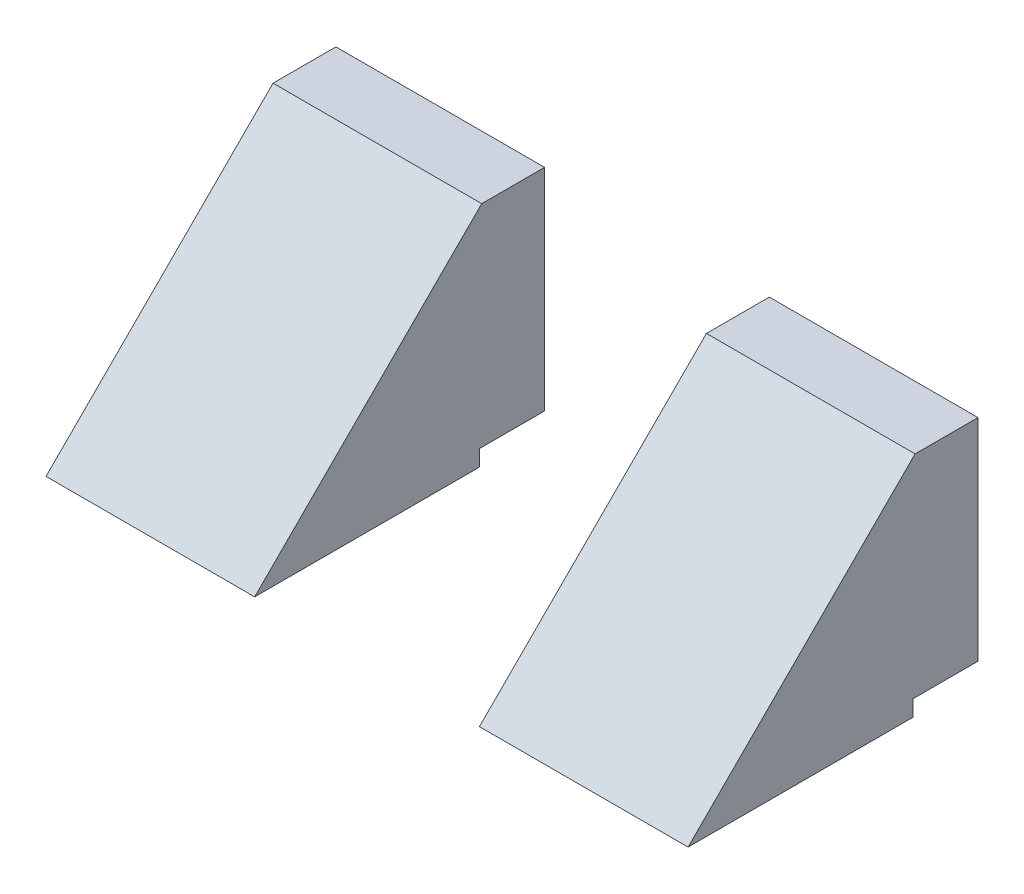
ISO-10303-21;
HEADER;
FILE_DESCRIPTION(('STEP AP214'),'2;1');
FILE_NAME('part.step','',(''),(''),'','','');
FILE_SCHEMA(('AUTOMOTIVE_DESIGN { 1 0 10303 214 1 1 1 1 }'));
ENDSEC;
DATA;
#1=APPLICATION_CONTEXT('core data for automotive mechanical design processes');
#2=APPLICATION_PROTOCOL_DEFINITION('international standard','automotive_design',2000,#1);
#3=PRODUCT_CONTEXT('',#1,'mechanical');
#4=PRODUCT('Part','Part','',(#3));
#5=PRODUCT_RELATED_PRODUCT_CATEGORY('part','',(#4));
#6=PRODUCT_DEFINITION_FORMATION('','',#4);
#7=PRODUCT_DEFINITION_CONTEXT('part definition',#1,'design');
#8=PRODUCT_DEFINITION('design','',#6,#7);
#9=PRODUCT_DEFINITION_SHAPE('','',#8);
#10=(LENGTH_UNIT() NAMED_UNIT(*) SI_UNIT(.MILLI.,.METRE.));
#11=(NAMED_UNIT(*) PLANE_ANGLE_UNIT() SI_UNIT($,.RADIAN.));
#12=(NAMED_UNIT(*) SI_UNIT($,.STERADIAN.) SOLID_ANGLE_UNIT());
#13=UNCERTAINTY_MEASURE_WITH_UNIT(LENGTH_MEASURE(1.E-05),#10,'distance_accuracy_value','');
#14=(GEOMETRIC_REPRESENTATION_CONTEXT(3) GLOBAL_UNCERTAINTY_ASSIGNED_CONTEXT((#13)) GLOBAL_UNIT_ASSIGNED_CONTEXT((#10,
#11,#12)) REPRESENTATION_CONTEXT('',''));
#15=CARTESIAN_POINT('',(0.,0.,0.));
#16=DIRECTION('',(0.,0.,1.));
#17=DIRECTION('',(1.,0.,0.));
#18=AXIS2_PLACEMENT_3D('',#15,#16,#17);
#19=CARTESIAN_POINT('',(200.,-25.754686226569,1.98850855745727));
#20=DIRECTION('',(0.,0.,1.));
#21=DIRECTION('',(0.,-1.,0.));
#22=AXIS2_PLACEMENT_3D('',#19,#20,#21);
#23=PLANE('',#22);
#24=DIRECTION('',(-1.,0.,0.));
#25=VECTOR('',#24,1.);
#26=CARTESIAN_POINT('',(200.,39.9594892936135,1.98850855745727));
#27=LINE('',#26,#25);
#28=CARTESIAN_POINT('',(65.,39.9594892936135,1.98850855745727));
#29=VERTEX_POINT('',#28);
#30=CARTESIAN_POINT('',(0.,39.9594892936135,1.98850855745727));
#31=VERTEX_POINT('',#30);
#32=EDGE_CURVE('E105',#29,#31,#27,.T.);
#33=ORIENTED_EDGE('',*,*,#32,.F.);
#34=DIRECTION('',(0.,1.,0.));
#35=VECTOR('',#34,1.);
#36=CARTESIAN_POINT('',(65.,-198.040510706386,1.98850855745735));
#37=LINE('',#36,#35);
#38=CARTESIAN_POINT('',(65.,-25.754686226569,1.98850855745729));
#39=VERTEX_POINT('',#38);
#40=EDGE_CURVE('E59',#39,#29,#37,.T.);
#41=ORIENTED_EDGE('',*,*,#40,.F.);
#42=DIRECTION('',(-1.,0.,0.));
#43=VECTOR('',#42,1.);
#44=CARTESIAN_POINT('',(200.,-25.754686226569,1.98850855745727));
#45=LINE('',#44,#43);
#46=CARTESIAN_POINT('',(0.,-25.754686226569,1.98850855745727));
#47=VERTEX_POINT('',#46);
#48=EDGE_CURVE('E52',#39,#47,#45,.T.);
#49=ORIENTED_EDGE('',*,*,#48,.T.);
#50=DIRECTION('',(0.,1.,0.));
#51=VECTOR('',#50,1.);
#52=CARTESIAN_POINT('',(0.,-25.754686226569,1.98850855745727));
#53=LINE('',#52,#51);
#54=EDGE_CURVE('E114',#47,#31,#53,.T.);
#55=ORIENTED_EDGE('',*,*,#54,.T.);
#56=EDGE_LOOP('',(#33,#41,#49,#55));
#57=FACE_BOUND('',#56,.T.);
#58=ADVANCED_FACE('F49',(#57),#23,.F.);
#59=CARTESIAN_POINT('',(200.,39.9594892936135,1.98850855745727));
#60=DIRECTION('',(0.,-1.,0.));
#61=DIRECTION('',(0.,0.,-1.));
#62=AXIS2_PLACEMENT_3D('',#59,#60,#61);
#63=PLANE('',#62);
#64=DIRECTION('',(-1.,0.,0.));
#65=VECTOR('',#64,1.);
#66=CARTESIAN_POINT('',(200.,39.9594892936135,21.574333037274));
#67=LINE('',#66,#65);
#68=CARTESIAN_POINT('',(65.,39.9594892936135,21.574333037274));
#69=VERTEX_POINT('',#68);
#70=CARTESIAN_POINT('',(0.,39.9594892936135,21.574333037274));
#71=VERTEX_POINT('',#70);
#72=EDGE_CURVE('E134',#69,#71,#67,.T.);
#73=ORIENTED_EDGE('',*,*,#72,.F.);
#74=DIRECTION('',(0.,0.,1.));
#75=VECTOR('',#74,1.);
#76=CARTESIAN_POINT('',(65.,39.9594892936135,1.98850855745727));
#77=LINE('',#76,#75);
#78=EDGE_CURVE('E12',#29,#69,#77,.T.);
#79=ORIENTED_EDGE('',*,*,#78,.F.);
#80=ORIENTED_EDGE('',*,*,#32,.T.);
#81=DIRECTION('',(0.,0.,1.));
#82=VECTOR('',#81,1.);
#83=CARTESIAN_POINT('',(0.,39.9594892936135,1.98850855745727));
#84=LINE('',#83,#82);
#85=EDGE_CURVE('E109',#31,#71,#84,.T.);
#86=ORIENTED_EDGE('',*,*,#85,.T.);
#87=EDGE_LOOP('',(#73,#79,#80,#86));
#88=FACE_BOUND('',#87,.T.);
#89=ADVANCED_FACE('F108',(#88),#63,.F.);
#90=CARTESIAN_POINT('',(200.,39.9594892936135,21.574333037274));
#91=DIRECTION('',(0.,-0.707106781186551,-0.707106781186544));
#92=DIRECTION('',(0.,0.707106781186544,-0.707106781186551));
#93=AXIS2_PLACEMENT_3D('',#90,#91,#92);
#94=PLANE('',#93);
#95=DIRECTION('',(-1.,0.,0.));
#96=VECTOR('',#95,1.);
#97=CARTESIAN_POINT('',(200.,-30.754686226569,92.2885085574573));
#98=LINE('',#97,#96);
#99=CARTESIAN_POINT('',(65.,-30.754686226569,92.2885085574573));
#100=VERTEX_POINT('',#99);
#101=CARTESIAN_POINT('',(0.,-30.754686226569,92.2885085574573));
#102=VERTEX_POINT('',#101);
#103=EDGE_CURVE('E138',#100,#102,#98,.T.);
#104=ORIENTED_EDGE('',*,*,#103,.F.);
#105=DIRECTION('',(0.,0.707106781186544,-0.707106781186551));
#106=VECTOR('',#105,1.);
#107=CARTESIAN_POINT('',(65.,39.9594892936135,21.574333037274));
#108=LINE('',#107,#106);
#109=EDGE_CURVE('E67',#100,#69,#108,.T.);
#110=ORIENTED_EDGE('',*,*,#109,.T.);
#111=ORIENTED_EDGE('',*,*,#72,.T.);
#112=DIRECTION('',(0.,-0.707106781186544,0.707106781186551));
#113=VECTOR('',#112,1.);
#114=CARTESIAN_POINT('',(0.,39.9594892936135,21.574333037274));
#115=LINE('',#114,#113);
#116=EDGE_CURVE('E122',#71,#102,#115,.T.);
#117=ORIENTED_EDGE('',*,*,#116,.T.);
#118=EDGE_LOOP('',(#104,#110,#111,#117));
#119=FACE_BOUND('',#118,.T.);
#120=ADVANCED_FACE('F169',(#119),#94,.F.);
#121=CARTESIAN_POINT('',(200.,-30.754686226569,92.2885085574573));
#122=DIRECTION('',(0.,1.,0.));
#123=DIRECTION('',(0.,0.,1.));
#124=AXIS2_PLACEMENT_3D('',#121,#122,#123);
#125=PLANE('',#124);
#126=DIRECTION('',(-1.,0.,0.));
#127=VECTOR('',#126,1.);
#128=CARTESIAN_POINT('',(200.,-30.754686226569,22.2885085574573));
#129=LINE('',#128,#127);
#130=CARTESIAN_POINT('',(65.,-30.754686226569,22.2885085574573));
#131=VERTEX_POINT('',#130);
#132=CARTESIAN_POINT('',(0.,-30.754686226569,22.2885085574573));
#133=VERTEX_POINT('',#132);
#134=EDGE_CURVE('E141',#131,#133,#129,.T.);
#135=ORIENTED_EDGE('',*,*,#134,.F.);
#136=DIRECTION('',(0.,0.,1.));
#137=VECTOR('',#136,1.);
#138=CARTESIAN_POINT('',(65.,-30.754686226569,92.2885085574573));
#139=LINE('',#138,#137);
#140=EDGE_CURVE('E135',#131,#100,#139,.T.);
#141=ORIENTED_EDGE('',*,*,#140,.T.);
#142=ORIENTED_EDGE('',*,*,#103,.T.);
#143=DIRECTION('',(0.,0.,-1.));
#144=VECTOR('',#143,1.);
#145=CARTESIAN_POINT('',(0.,-30.754686226569,92.2885085574573));
#146=LINE('',#145,#144);
#147=EDGE_CURVE('E142',#102,#133,#146,.T.);
#148=ORIENTED_EDGE('',*,*,#147,.T.);
#149=EDGE_LOOP('',(#135,#141,#142,#148));
#150=FACE_BOUND('',#149,.T.);
#151=ADVANCED_FACE('F173',(#150),#125,.F.);
#152=CARTESIAN_POINT('',(200.,-30.754686226569,22.2885085574573));
#153=DIRECTION('',(0.,0.,1.));
#154=DIRECTION('',(1.,0.,0.));
#155=AXIS2_PLACEMENT_3D('',#152,#153,#154);
#156=PLANE('',#155);
#157=DIRECTION('',(-1.,0.,0.));
#158=VECTOR('',#157,1.);
#159=CARTESIAN_POINT('',(200.,-25.754686226569,22.2885085574573));
#160=LINE('',#159,#158);
#161=CARTESIAN_POINT('',(65.,-25.754686226569,22.2885085574573));
#162=VERTEX_POINT('',#161);
#163=CARTESIAN_POINT('',(0.,-25.754686226569,22.2885085574573));
#164=VERTEX_POINT('',#163);
#165=EDGE_CURVE('E152',#162,#164,#160,.T.);
#166=ORIENTED_EDGE('',*,*,#165,.F.);
#167=DIRECTION('',(0.,-1.,0.));
#168=VECTOR('',#167,1.);
#169=CARTESIAN_POINT('',(65.,-30.754686226569,22.2885085574573));
#170=LINE('',#169,#168);
#171=EDGE_CURVE('E83',#162,#131,#170,.T.);
#172=ORIENTED_EDGE('',*,*,#171,.T.);
#173=ORIENTED_EDGE('',*,*,#134,.T.);
#174=DIRECTION('',(0.,1.,0.));
#175=VECTOR('',#174,1.);
#176=CARTESIAN_POINT('',(0.,-30.754686226569,22.2885085574573));
#177=LINE('',#176,#175);
#178=EDGE_CURVE('E151',#133,#164,#177,.T.);
#179=ORIENTED_EDGE('',*,*,#178,.T.);
#180=EDGE_LOOP('',(#166,#172,#173,#179));
#181=FACE_BOUND('',#180,.T.);
#182=ADVANCED_FACE('F176',(#181),#156,.F.);
#183=CARTESIAN_POINT('',(200.,-25.754686226569,22.2885085574573));
#184=DIRECTION('',(0.,1.,0.));
#185=DIRECTION('',(0.,0.,1.));
#186=AXIS2_PLACEMENT_3D('',#183,#184,#185);
#187=PLANE('',#186);
#188=ORIENTED_EDGE('',*,*,#48,.F.);
#189=DIRECTION('',(0.,0.,1.));
#190=VECTOR('',#189,1.);
#191=CARTESIAN_POINT('',(65.,-25.754686226569,22.2885085574573));
#192=LINE('',#191,#190);
#193=EDGE_CURVE('E79',#39,#162,#192,.T.);
#194=ORIENTED_EDGE('',*,*,#193,.T.);
#195=ORIENTED_EDGE('',*,*,#165,.T.);
#196=DIRECTION('',(0.,0.,-1.));
#197=VECTOR('',#196,1.);
#198=CARTESIAN_POINT('',(0.,-25.754686226569,22.2885085574573));
#199=LINE('',#198,#197);
#200=EDGE_CURVE('E144',#164,#47,#199,.T.);
#201=ORIENTED_EDGE('',*,*,#200,.T.);
#202=EDGE_LOOP('',(#188,#194,#195,#201));
#203=FACE_BOUND('',#202,.T.);
#204=ADVANCED_FACE('F177',(#203),#187,.F.);
#205=CARTESIAN_POINT('',(0.,0.,0.));
#206=DIRECTION('',(1.,0.,0.));
#207=DIRECTION('',(0.,0.,-1.));
#208=AXIS2_PLACEMENT_3D('',#205,#206,#207);
#209=PLANE('',#208);
#210=ORIENTED_EDGE('',*,*,#54,.F.);
#211=ORIENTED_EDGE('',*,*,#200,.F.);
#212=ORIENTED_EDGE('',*,*,#178,.F.);
#213=ORIENTED_EDGE('',*,*,#147,.F.);
#214=ORIENTED_EDGE('',*,*,#116,.F.);
#215=ORIENTED_EDGE('',*,*,#85,.F.);
#216=EDGE_LOOP('',(#210,#211,#212,#213,#214,#215));
#217=FACE_BOUND('',#216,.T.);
#218=ADVANCED_FACE('F118',(#217),#209,.F.);
#219=CARTESIAN_POINT('',(65.,-198.040510706386,1.98850855745735));
#220=DIRECTION('',(-1.,0.,0.));
#221=DIRECTION('',(0.,0.,1.));
#222=AXIS2_PLACEMENT_3D('',#219,#220,#221);
#223=PLANE('',#222);
#224=ORIENTED_EDGE('',*,*,#140,.F.);
#225=ORIENTED_EDGE('',*,*,#171,.F.);
#226=ORIENTED_EDGE('',*,*,#193,.F.);
#227=ORIENTED_EDGE('',*,*,#40,.T.);
#228=ORIENTED_EDGE('',*,*,#78,.T.);
#229=ORIENTED_EDGE('',*,*,#109,.F.);
#230=EDGE_LOOP('',(#224,#225,#226,#227,#228,#229));
#231=FACE_BOUND('',#230,.T.);
#232=ADVANCED_FACE('F174',(#231),#223,.F.);
#233=CLOSED_SHELL('',(#58,#89,#120,#151,#182,#204,#218,#232));
#234=MANIFOLD_SOLID_BREP('B2',#233);
#235=CARTESIAN_POINT('',(200.,0.,0.));
#236=DIRECTION('',(1.,0.,0.));
#237=DIRECTION('',(0.,0.,-1.));
#238=AXIS2_PLACEMENT_3D('',#235,#236,#237);
#239=PLANE('',#238);
#240=DIRECTION('',(0.,1.,0.));
#241=VECTOR('',#240,1.);
#242=CARTESIAN_POINT('',(200.,-25.754686226569,1.98850855745727));
#243=LINE('',#242,#241);
#244=CARTESIAN_POINT('',(200.,-25.754686226569,1.98850855745727));
#245=VERTEX_POINT('',#244);
#246=CARTESIAN_POINT('',(200.,39.9594892936135,1.98850855745727));
#247=VERTEX_POINT('',#246);
#248=EDGE_CURVE('E333',#245,#247,#243,.T.);
#249=ORIENTED_EDGE('',*,*,#248,.T.);
#250=DIRECTION('',(0.,0.,1.));
#251=VECTOR('',#250,1.);
#252=CARTESIAN_POINT('',(200.,39.9594892936135,1.98850855745727));
#253=LINE('',#252,#251);
#254=CARTESIAN_POINT('',(200.,39.9594892936135,21.574333037274));
#255=VERTEX_POINT('',#254);
#256=EDGE_CURVE('E311',#247,#255,#253,.T.);
#257=ORIENTED_EDGE('',*,*,#256,.T.);
#258=DIRECTION('',(0.,-0.707106781186544,0.707106781186551));
#259=VECTOR('',#258,1.);
#260=CARTESIAN_POINT('',(200.,39.9594892936135,21.574333037274));
#261=LINE('',#260,#259);
#262=CARTESIAN_POINT('',(200.,-30.754686226569,92.2885085574573));
#263=VERTEX_POINT('',#262);
#264=EDGE_CURVE('E330',#255,#263,#261,.T.);
#265=ORIENTED_EDGE('',*,*,#264,.T.);
#266=DIRECTION('',(0.,0.,-1.));
#267=VECTOR('',#266,1.);
#268=CARTESIAN_POINT('',(200.,-30.754686226569,92.2885085574573));
#269=LINE('',#268,#267);
#270=CARTESIAN_POINT('',(200.,-30.754686226569,22.2885085574573));
#271=VERTEX_POINT('',#270);
#272=EDGE_CURVE('E328',#263,#271,#269,.T.);
#273=ORIENTED_EDGE('',*,*,#272,.T.);
#274=DIRECTION('',(0.,1.,0.));
#275=VECTOR('',#274,1.);
#276=CARTESIAN_POINT('',(200.,-30.754686226569,22.2885085574573));
#277=LINE('',#276,#275);
#278=CARTESIAN_POINT('',(200.,-25.754686226569,22.2885085574573));
#279=VERTEX_POINT('',#278);
#280=EDGE_CURVE('E326',#271,#279,#277,.T.);
#281=ORIENTED_EDGE('',*,*,#280,.T.);
#282=DIRECTION('',(0.,0.,-1.));
#283=VECTOR('',#282,1.);
#284=CARTESIAN_POINT('',(200.,-25.754686226569,22.2885085574573));
#285=LINE('',#284,#283);
#286=EDGE_CURVE('E265',#279,#245,#285,.T.);
#287=ORIENTED_EDGE('',*,*,#286,.T.);
#288=EDGE_LOOP('',(#249,#257,#265,#273,#281,#287));
#289=FACE_BOUND('',#288,.T.);
#290=ADVANCED_FACE('F243',(#289),#239,.T.);
#291=CARTESIAN_POINT('',(200.,-25.754686226569,22.2885085574573));
#292=DIRECTION('',(0.,1.,0.));
#293=DIRECTION('',(0.,0.,1.));
#294=AXIS2_PLACEMENT_3D('',#291,#292,#293);
#295=PLANE('',#294);
#296=DIRECTION('',(-1.,0.,0.));
#297=VECTOR('',#296,1.);
#298=CARTESIAN_POINT('',(200.,-25.754686226569,22.2885085574573));
#299=LINE('',#298,#297);
#300=CARTESIAN_POINT('',(135.,-25.754686226569,22.2885085574573));
#301=VERTEX_POINT('',#300);
#302=EDGE_CURVE('E321',#279,#301,#299,.T.);
#303=ORIENTED_EDGE('',*,*,#302,.T.);
#304=DIRECTION('',(0.,0.,-1.));
#305=VECTOR('',#304,1.);
#306=CARTESIAN_POINT('',(135.,-25.754686226569,22.2885085574573));
#307=LINE('',#306,#305);
#308=CARTESIAN_POINT('',(135.,-25.754686226569,1.98850855745727));
#309=VERTEX_POINT('',#308);
#310=EDGE_CURVE('E47',#301,#309,#307,.T.);
#311=ORIENTED_EDGE('',*,*,#310,.T.);
#312=DIRECTION('',(-1.,0.,0.));
#313=VECTOR('',#312,1.);
#314=CARTESIAN_POINT('',(200.,-25.754686226569,1.98850855745727));
#315=LINE('',#314,#313);
#316=EDGE_CURVE('E307',#245,#309,#315,.T.);
#317=ORIENTED_EDGE('',*,*,#316,.F.);
#318=ORIENTED_EDGE('',*,*,#286,.F.);
#319=EDGE_LOOP('',(#303,#311,#317,#318));
#320=FACE_BOUND('',#319,.T.);
#321=ADVANCED_FACE('F346',(#320),#295,.F.);
#322=CARTESIAN_POINT('',(200.,-30.754686226569,22.2885085574573));
#323=DIRECTION('',(0.,0.,1.));
#324=DIRECTION('',(1.,0.,0.));
#325=AXIS2_PLACEMENT_3D('',#322,#323,#324);
#326=PLANE('',#325);
#327=DIRECTION('',(-1.,0.,0.));
#328=VECTOR('',#327,1.);
#329=CARTESIAN_POINT('',(200.,-30.754686226569,22.2885085574573));
#330=LINE('',#329,#328);
#331=CARTESIAN_POINT('',(135.,-30.754686226569,22.2885085574573));
#332=VERTEX_POINT('',#331);
#333=EDGE_CURVE('E318',#271,#332,#330,.T.);
#334=ORIENTED_EDGE('',*,*,#333,.T.);
#335=DIRECTION('',(0.,1.,0.));
#336=VECTOR('',#335,1.);
#337=CARTESIAN_POINT('',(135.,-30.754686226569,22.2885085574573));
#338=LINE('',#337,#336);
#339=EDGE_CURVE('E308',#332,#301,#338,.T.);
#340=ORIENTED_EDGE('',*,*,#339,.T.);
#341=ORIENTED_EDGE('',*,*,#302,.F.);
#342=ORIENTED_EDGE('',*,*,#280,.F.);
#343=EDGE_LOOP('',(#334,#340,#341,#342));
#344=FACE_BOUND('',#343,.T.);
#345=ADVANCED_FACE('F342',(#344),#326,.F.);
#346=CARTESIAN_POINT('',(200.,-30.754686226569,92.2885085574573));
#347=DIRECTION('',(0.,1.,0.));
#348=DIRECTION('',(0.,0.,1.));
#349=AXIS2_PLACEMENT_3D('',#346,#347,#348);
#350=PLANE('',#349);
#351=DIRECTION('',(-1.,0.,0.));
#352=VECTOR('',#351,1.);
#353=CARTESIAN_POINT('',(200.,-30.754686226569,92.2885085574573));
#354=LINE('',#353,#352);
#355=CARTESIAN_POINT('',(135.,-30.754686226569,92.2885085574573));
#356=VERTEX_POINT('',#355);
#357=EDGE_CURVE('E313',#263,#356,#354,.T.);
#358=ORIENTED_EDGE('',*,*,#357,.T.);
#359=DIRECTION('',(0.,0.,-1.));
#360=VECTOR('',#359,1.);
#361=CARTESIAN_POINT('',(135.,-30.754686226569,92.2885085574573));
#362=LINE('',#361,#360);
#363=EDGE_CURVE('E336',#356,#332,#362,.T.);
#364=ORIENTED_EDGE('',*,*,#363,.T.);
#365=ORIENTED_EDGE('',*,*,#333,.F.);
#366=ORIENTED_EDGE('',*,*,#272,.F.);
#367=EDGE_LOOP('',(#358,#364,#365,#366));
#368=FACE_BOUND('',#367,.T.);
#369=ADVANCED_FACE('F353',(#368),#350,.F.);
#370=CARTESIAN_POINT('',(200.,39.9594892936135,21.574333037274));
#371=DIRECTION('',(0.,-0.707106781186551,-0.707106781186544));
#372=DIRECTION('',(0.,0.707106781186544,-0.707106781186551));
#373=AXIS2_PLACEMENT_3D('',#370,#371,#372);
#374=PLANE('',#373);
#375=DIRECTION('',(-1.,0.,0.));
#376=VECTOR('',#375,1.);
#377=CARTESIAN_POINT('',(200.,39.9594892936135,21.574333037274));
#378=LINE('',#377,#376);
#379=CARTESIAN_POINT('',(135.,39.9594892936135,21.574333037274));
#380=VERTEX_POINT('',#379);
#381=EDGE_CURVE('E312',#255,#380,#378,.T.);
#382=ORIENTED_EDGE('',*,*,#381,.T.);
#383=DIRECTION('',(0.,-0.707106781186544,0.707106781186551));
#384=VECTOR('',#383,1.);
#385=CARTESIAN_POINT('',(135.,39.9594892936135,21.574333037274));
#386=LINE('',#385,#384);
#387=EDGE_CURVE('E297',#380,#356,#386,.T.);
#388=ORIENTED_EDGE('',*,*,#387,.T.);
#389=ORIENTED_EDGE('',*,*,#357,.F.);
#390=ORIENTED_EDGE('',*,*,#264,.F.);
#391=EDGE_LOOP('',(#382,#388,#389,#390));
#392=FACE_BOUND('',#391,.T.);
#393=ADVANCED_FACE('F350',(#392),#374,.F.);
#394=CARTESIAN_POINT('',(200.,39.9594892936135,1.98850855745727));
#395=DIRECTION('',(0.,-1.,0.));
#396=DIRECTION('',(0.,0.,-1.));
#397=AXIS2_PLACEMENT_3D('',#394,#395,#396);
#398=PLANE('',#397);
#399=DIRECTION('',(-1.,0.,0.));
#400=VECTOR('',#399,1.);
#401=CARTESIAN_POINT('',(200.,39.9594892936135,1.98850855745727));
#402=LINE('',#401,#400);
#403=CARTESIAN_POINT('',(135.,39.9594892936135,1.98850855745727));
#404=VERTEX_POINT('',#403);
#405=EDGE_CURVE('E251',#247,#404,#402,.T.);
#406=ORIENTED_EDGE('',*,*,#405,.T.);
#407=DIRECTION('',(0.,0.,-1.));
#408=VECTOR('',#407,1.);
#409=CARTESIAN_POINT('',(135.,39.9594892936135,1.98850855745727));
#410=LINE('',#409,#408);
#411=EDGE_CURVE('E294',#380,#404,#410,.T.);
#412=ORIENTED_EDGE('',*,*,#411,.F.);
#413=ORIENTED_EDGE('',*,*,#381,.F.);
#414=ORIENTED_EDGE('',*,*,#256,.F.);
#415=EDGE_LOOP('',(#406,#412,#413,#414));
#416=FACE_BOUND('',#415,.T.);
#417=ADVANCED_FACE('F310',(#416),#398,.F.);
#418=CARTESIAN_POINT('',(200.,-25.754686226569,1.98850855745727));
#419=DIRECTION('',(0.,0.,1.));
#420=DIRECTION('',(0.,-1.,0.));
#421=AXIS2_PLACEMENT_3D('',#418,#419,#420);
#422=PLANE('',#421);
#423=ORIENTED_EDGE('',*,*,#316,.T.);
#424=DIRECTION('',(0.,1.,0.));
#425=VECTOR('',#424,1.);
#426=CARTESIAN_POINT('',(135.,-198.040510706386,1.98850855745735));
#427=LINE('',#426,#425);
#428=EDGE_CURVE('E258',#309,#404,#427,.T.);
#429=ORIENTED_EDGE('',*,*,#428,.T.);
#430=ORIENTED_EDGE('',*,*,#405,.F.);
#431=ORIENTED_EDGE('',*,*,#248,.F.);
#432=EDGE_LOOP('',(#423,#429,#430,#431));
#433=FACE_BOUND('',#432,.T.);
#434=ADVANCED_FACE('F245',(#433),#422,.F.);
#435=CARTESIAN_POINT('',(135.,-198.040510706386,1.98850855745735));
#436=DIRECTION('',(1.,0.,0.));
#437=DIRECTION('',(0.,0.,-1.));
#438=AXIS2_PLACEMENT_3D('',#435,#436,#437);
#439=PLANE('',#438);
#440=ORIENTED_EDGE('',*,*,#411,.T.);
#441=ORIENTED_EDGE('',*,*,#428,.F.);
#442=ORIENTED_EDGE('',*,*,#310,.F.);
#443=ORIENTED_EDGE('',*,*,#339,.F.);
#444=ORIENTED_EDGE('',*,*,#363,.F.);
#445=ORIENTED_EDGE('',*,*,#387,.F.);
#446=EDGE_LOOP('',(#440,#441,#442,#443,#444,#445));
#447=FACE_BOUND('',#446,.T.);
#448=ADVANCED_FACE('F295',(#447),#439,.F.);
#449=CLOSED_SHELL('',(#290,#321,#345,#369,#393,#417,#434,#448));
#450=MANIFOLD_SOLID_BREP('B6',#449);
#451=ADVANCED_BREP_SHAPE_REPRESENTATION('',(#18,#234,#450),#14);
#452=SHAPE_DEFINITION_REPRESENTATION(#9,#451);
ENDSEC;
END-ISO-10303-21;
